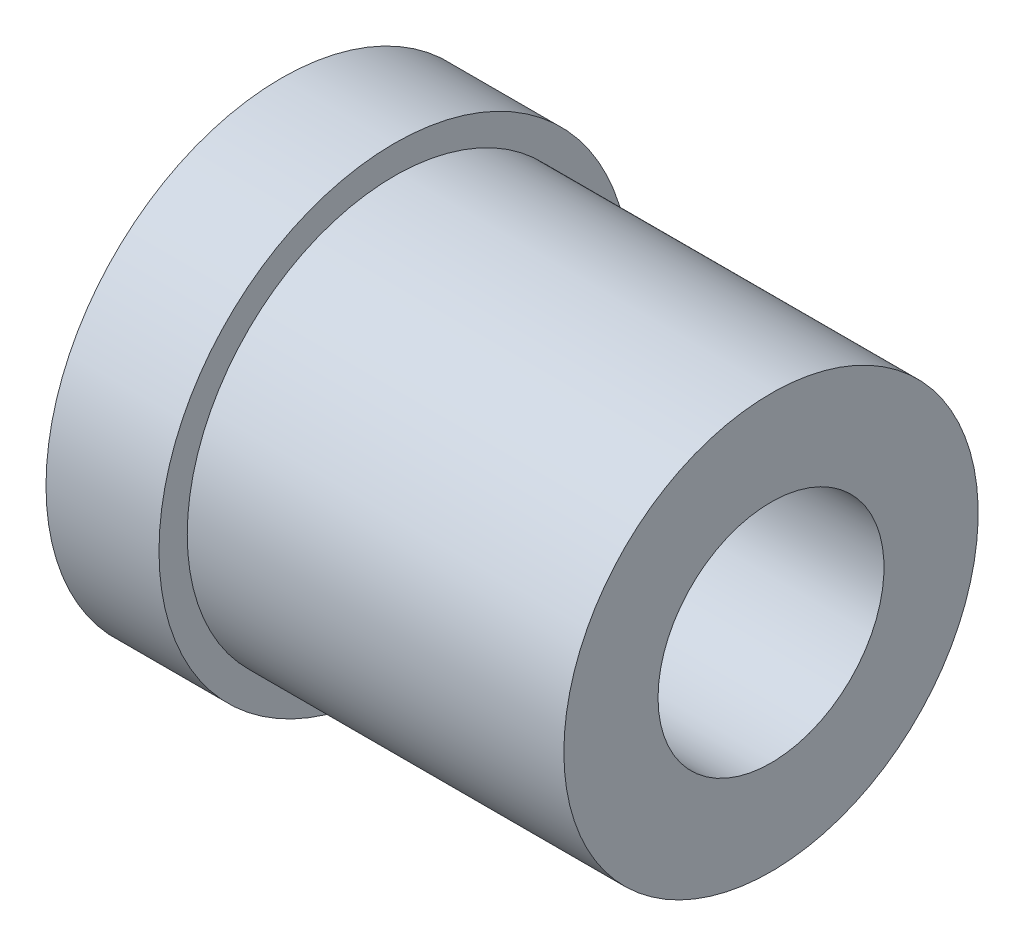
ISO-10303-21;
HEADER;
FILE_DESCRIPTION(('STEP AP214'),'2;1');
FILE_NAME('part.step','',(''),(''),'','','');
FILE_SCHEMA(('AUTOMOTIVE_DESIGN { 1 0 10303 214 1 1 1 1 }'));
ENDSEC;
DATA;
#1=APPLICATION_CONTEXT('core data for automotive mechanical design processes');
#2=APPLICATION_PROTOCOL_DEFINITION('international standard','automotive_design',2000,#1);
#3=PRODUCT_CONTEXT('',#1,'mechanical');
#4=PRODUCT('Part','Part','',(#3));
#5=PRODUCT_RELATED_PRODUCT_CATEGORY('part','',(#4));
#6=PRODUCT_DEFINITION_FORMATION('','',#4);
#7=PRODUCT_DEFINITION_CONTEXT('part definition',#1,'design');
#8=PRODUCT_DEFINITION('design','',#6,#7);
#9=PRODUCT_DEFINITION_SHAPE('','',#8);
#10=(LENGTH_UNIT() NAMED_UNIT(*) SI_UNIT(.MILLI.,.METRE.));
#11=(NAMED_UNIT(*) PLANE_ANGLE_UNIT() SI_UNIT($,.RADIAN.));
#12=(NAMED_UNIT(*) SI_UNIT($,.STERADIAN.) SOLID_ANGLE_UNIT());
#13=UNCERTAINTY_MEASURE_WITH_UNIT(LENGTH_MEASURE(1.E-05),#10,'distance_accuracy_value','');
#14=(GEOMETRIC_REPRESENTATION_CONTEXT(3) GLOBAL_UNCERTAINTY_ASSIGNED_CONTEXT((#13)) GLOBAL_UNIT_ASSIGNED_CONTEXT((#10,
#11,#12)) REPRESENTATION_CONTEXT('',''));
#15=CARTESIAN_POINT('',(0.,0.,0.));
#16=DIRECTION('',(0.,0.,1.));
#17=DIRECTION('',(1.,0.,0.));
#18=AXIS2_PLACEMENT_3D('',#15,#16,#17);
#19=CARTESIAN_POINT('',(0.,0.,0.));
#20=DIRECTION('',(-1.,0.,0.));
#21=DIRECTION('',(0.,0.,1.));
#22=AXIS2_PLACEMENT_3D('',#19,#20,#21);
#23=CYLINDRICAL_SURFACE('',#22,12.5);
#24=CARTESIAN_POINT('',(0.,0.,0.));
#25=DIRECTION('',(-1.,0.,0.));
#26=DIRECTION('',(0.,0.,1.));
#27=AXIS2_PLACEMENT_3D('',#24,#25,#26);
#28=CIRCLE('',#27,12.5);
#29=CARTESIAN_POINT('',(0.,0.,12.5));
#30=VERTEX_POINT('',#29);
#31=EDGE_CURVE('E12',#30,#30,#28,.T.);
#32=ORIENTED_EDGE('',*,*,#31,.F.);
#33=EDGE_LOOP('',(#32));
#34=FACE_BOUND('',#33,.T.);
#35=CARTESIAN_POINT('',(6.00000000000001,0.,0.));
#36=DIRECTION('',(-1.,0.,0.));
#37=DIRECTION('',(0.,0.,1.));
#38=AXIS2_PLACEMENT_3D('',#35,#36,#37);
#39=CIRCLE('',#38,12.5);
#40=CARTESIAN_POINT('',(6.00000000000001,0.,12.5));
#41=VERTEX_POINT('',#40);
#42=EDGE_CURVE('E62',#41,#41,#39,.T.);
#43=ORIENTED_EDGE('',*,*,#42,.T.);
#44=EDGE_LOOP('',(#43));
#45=FACE_BOUND('',#44,.T.);
#46=ADVANCED_FACE('F40',(#34,#45),#23,.T.);
#47=CARTESIAN_POINT('',(0.,12.5,0.));
#48=DIRECTION('',(1.,0.,0.));
#49=DIRECTION('',(0.,0.,-1.));
#50=AXIS2_PLACEMENT_3D('',#47,#48,#49);
#51=PLANE('',#50);
#52=CARTESIAN_POINT('',(0.,0.,0.));
#53=DIRECTION('',(-1.,0.,0.));
#54=DIRECTION('',(0.,0.,1.));
#55=AXIS2_PLACEMENT_3D('',#52,#53,#54);
#56=CIRCLE('',#55,6.);
#57=CARTESIAN_POINT('',(0.,0.,6.));
#58=VERTEX_POINT('',#57);
#59=EDGE_CURVE('E46',#58,#58,#56,.T.);
#60=ORIENTED_EDGE('',*,*,#59,.F.);
#61=EDGE_LOOP('',(#60));
#62=FACE_BOUND('',#61,.T.);
#63=ORIENTED_EDGE('',*,*,#31,.T.);
#64=EDGE_LOOP('',(#63));
#65=FACE_BOUND('',#64,.T.);
#66=ADVANCED_FACE('F87',(#62,#65),#51,.F.);
#67=CARTESIAN_POINT('',(0.,0.,0.));
#68=DIRECTION('',(-1.,0.,0.));
#69=DIRECTION('',(0.,0.,1.));
#70=AXIS2_PLACEMENT_3D('',#67,#68,#69);
#71=CYLINDRICAL_SURFACE('',#70,6.);
#72=CARTESIAN_POINT('',(26.,0.,0.));
#73=DIRECTION('',(-1.,0.,0.));
#74=DIRECTION('',(0.,0.,1.));
#75=AXIS2_PLACEMENT_3D('',#72,#73,#74);
#76=CIRCLE('',#75,6.);
#77=CARTESIAN_POINT('',(26.,0.,6.));
#78=VERTEX_POINT('',#77);
#79=EDGE_CURVE('E50',#78,#78,#76,.T.);
#80=ORIENTED_EDGE('',*,*,#79,.F.);
#81=EDGE_LOOP('',(#80));
#82=FACE_BOUND('',#81,.T.);
#83=ORIENTED_EDGE('',*,*,#59,.T.);
#84=EDGE_LOOP('',(#83));
#85=FACE_BOUND('',#84,.T.);
#86=ADVANCED_FACE('F82',(#82,#85),#71,.F.);
#87=CARTESIAN_POINT('',(26.,6.,0.));
#88=DIRECTION('',(-1.,0.,0.));
#89=DIRECTION('',(0.,0.,1.));
#90=AXIS2_PLACEMENT_3D('',#87,#88,#89);
#91=PLANE('',#90);
#92=CARTESIAN_POINT('',(26.,0.,0.));
#93=DIRECTION('',(-1.,0.,0.));
#94=DIRECTION('',(0.,0.,1.));
#95=AXIS2_PLACEMENT_3D('',#92,#93,#94);
#96=CIRCLE('',#95,11.);
#97=CARTESIAN_POINT('',(26.,0.,11.));
#98=VERTEX_POINT('',#97);
#99=EDGE_CURVE('E54',#98,#98,#96,.T.);
#100=ORIENTED_EDGE('',*,*,#99,.F.);
#101=EDGE_LOOP('',(#100));
#102=FACE_BOUND('',#101,.T.);
#103=ORIENTED_EDGE('',*,*,#79,.T.);
#104=EDGE_LOOP('',(#103));
#105=FACE_BOUND('',#104,.T.);
#106=ADVANCED_FACE('F76',(#102,#105),#91,.F.);
#107=CARTESIAN_POINT('',(0.,0.,0.));
#108=DIRECTION('',(-1.,0.,0.));
#109=DIRECTION('',(0.,0.,1.));
#110=AXIS2_PLACEMENT_3D('',#107,#108,#109);
#111=CYLINDRICAL_SURFACE('',#110,11.);
#112=CARTESIAN_POINT('',(6.00000000000001,0.,0.));
#113=DIRECTION('',(-1.,0.,0.));
#114=DIRECTION('',(0.,0.,1.));
#115=AXIS2_PLACEMENT_3D('',#112,#113,#114);
#116=CIRCLE('',#115,11.);
#117=CARTESIAN_POINT('',(6.00000000000001,0.,11.));
#118=VERTEX_POINT('',#117);
#119=EDGE_CURVE('E59',#118,#118,#116,.T.);
#120=ORIENTED_EDGE('',*,*,#119,.F.);
#121=EDGE_LOOP('',(#120));
#122=FACE_BOUND('',#121,.T.);
#123=ORIENTED_EDGE('',*,*,#99,.T.);
#124=EDGE_LOOP('',(#123));
#125=FACE_BOUND('',#124,.T.);
#126=ADVANCED_FACE('F70',(#122,#125),#111,.T.);
#127=CARTESIAN_POINT('',(6.00000000000001,11.,0.));
#128=DIRECTION('',(-1.,0.,0.));
#129=DIRECTION('',(0.,0.,1.));
#130=AXIS2_PLACEMENT_3D('',#127,#128,#129);
#131=PLANE('',#130);
#132=ORIENTED_EDGE('',*,*,#42,.F.);
#133=EDGE_LOOP('',(#132));
#134=FACE_BOUND('',#133,.T.);
#135=ORIENTED_EDGE('',*,*,#119,.T.);
#136=EDGE_LOOP('',(#135));
#137=FACE_BOUND('',#136,.T.);
#138=ADVANCED_FACE('F67',(#134,#137),#131,.F.);
#139=CLOSED_SHELL('',(#46,#66,#86,#106,#126,#138));
#140=MANIFOLD_SOLID_BREP('B2',#139);
#141=ADVANCED_BREP_SHAPE_REPRESENTATION('',(#18,#140),#14);
#142=SHAPE_DEFINITION_REPRESENTATION(#9,#141);
ENDSEC;
END-ISO-10303-21;
